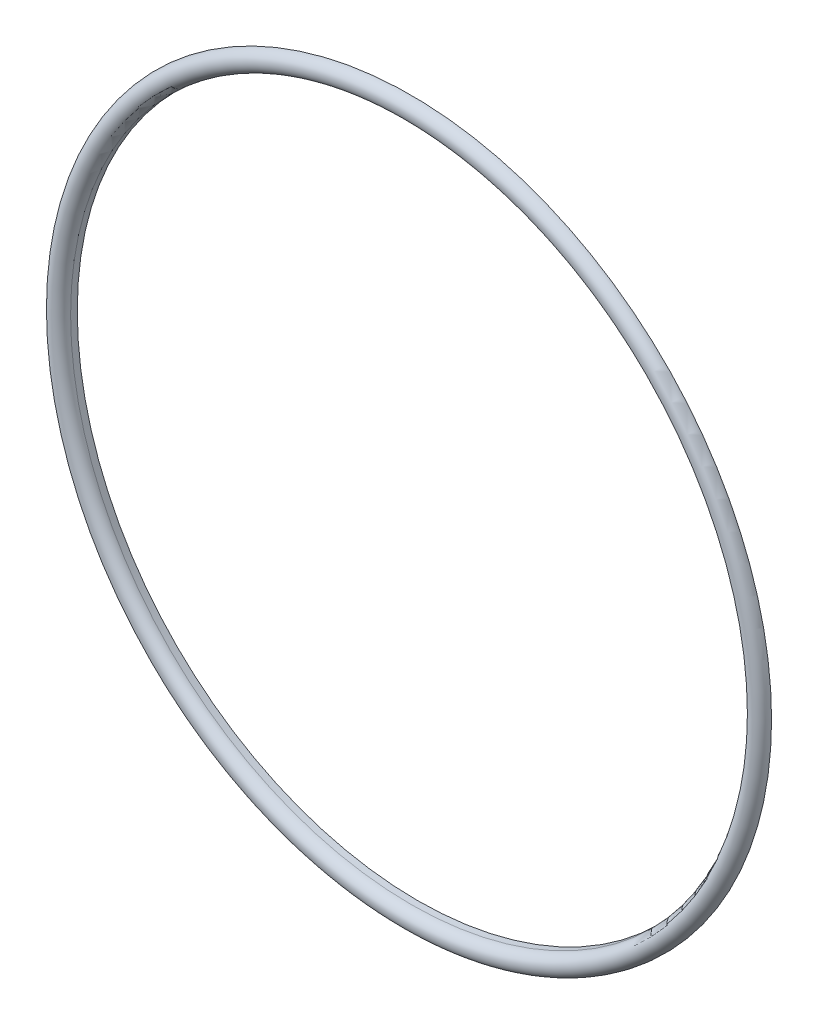
ISO-10303-21;
HEADER;
FILE_DESCRIPTION(('STEP AP214'),'2;1');
FILE_NAME('part.step','',(''),(''),'','','');
FILE_SCHEMA(('AUTOMOTIVE_DESIGN { 1 0 10303 214 1 1 1 1 }'));
ENDSEC;
DATA;
#1=APPLICATION_CONTEXT('core data for automotive mechanical design processes');
#2=APPLICATION_PROTOCOL_DEFINITION('international standard','automotive_design',2000,#1);
#3=PRODUCT_CONTEXT('',#1,'mechanical');
#4=PRODUCT('Part','Part','',(#3));
#5=PRODUCT_RELATED_PRODUCT_CATEGORY('part','',(#4));
#6=PRODUCT_DEFINITION_FORMATION('','',#4);
#7=PRODUCT_DEFINITION_CONTEXT('part definition',#1,'design');
#8=PRODUCT_DEFINITION('design','',#6,#7);
#9=PRODUCT_DEFINITION_SHAPE('','',#8);
#10=(LENGTH_UNIT() NAMED_UNIT(*) SI_UNIT(.MILLI.,.METRE.));
#11=(NAMED_UNIT(*) PLANE_ANGLE_UNIT() SI_UNIT($,.RADIAN.));
#12=(NAMED_UNIT(*) SI_UNIT($,.STERADIAN.) SOLID_ANGLE_UNIT());
#13=UNCERTAINTY_MEASURE_WITH_UNIT(LENGTH_MEASURE(1.E-05),#10,'distance_accuracy_value','');
#14=(GEOMETRIC_REPRESENTATION_CONTEXT(3) GLOBAL_UNCERTAINTY_ASSIGNED_CONTEXT((#13)) GLOBAL_UNIT_ASSIGNED_CONTEXT((#10,
#11,#12)) REPRESENTATION_CONTEXT('',''));
#15=CARTESIAN_POINT('',(0.,0.,0.));
#16=DIRECTION('',(0.,0.,1.));
#17=DIRECTION('',(1.,0.,0.));
#18=AXIS2_PLACEMENT_3D('',#15,#16,#17);
#19=CARTESIAN_POINT('',(0.,0.,0.));
#20=DIRECTION('',(0.,0.,-1.));
#21=DIRECTION('',(-1.,0.,0.));
#22=AXIS2_PLACEMENT_3D('',#19,#20,#21);
#23=CYLINDRICAL_SURFACE('',#22,52.5);
#24=CARTESIAN_POINT('',(0.,0.,0.));
#25=DIRECTION('',(0.,0.,-1.));
#26=DIRECTION('',(-1.,0.,0.));
#27=AXIS2_PLACEMENT_3D('',#24,#25,#26);
#28=CIRCLE('',#27,52.5);
#29=CARTESIAN_POINT('',(-52.5,0.,0.));
#30=VERTEX_POINT('',#29);
#31=EDGE_CURVE('E12',#30,#30,#28,.T.);
#32=ORIENTED_EDGE('',*,*,#31,.T.);
#33=EDGE_LOOP('',(#32));
#34=FACE_BOUND('',#33,.T.);
#35=CARTESIAN_POINT('',(0.,0.,-1.));
#36=DIRECTION('',(0.,0.,-1.));
#37=DIRECTION('',(-1.,0.,0.));
#38=AXIS2_PLACEMENT_3D('',#35,#36,#37);
#39=CIRCLE('',#38,52.5);
#40=CARTESIAN_POINT('',(-52.5,0.,-1.));
#41=VERTEX_POINT('',#40);
#42=EDGE_CURVE('E69',#41,#41,#39,.T.);
#43=ORIENTED_EDGE('',*,*,#42,.F.);
#44=EDGE_LOOP('',(#43));
#45=FACE_BOUND('',#44,.T.);
#46=ADVANCED_FACE('F46',(#34,#45),#23,.T.);
#47=CARTESIAN_POINT('',(0.,54.,0.));
#48=DIRECTION('',(0.,0.,-1.));
#49=DIRECTION('',(-1.,0.,0.));
#50=AXIS2_PLACEMENT_3D('',#47,#48,#49);
#51=PLANE('',#50);
#52=CARTESIAN_POINT('',(0.,0.,0.));
#53=DIRECTION('',(0.,0.,-1.));
#54=DIRECTION('',(-1.,0.,0.));
#55=AXIS2_PLACEMENT_3D('',#52,#53,#54);
#56=CIRCLE('',#55,54.);
#57=CARTESIAN_POINT('',(-54.,0.,0.));
#58=VERTEX_POINT('',#57);
#59=EDGE_CURVE('E53',#58,#58,#56,.T.);
#60=ORIENTED_EDGE('',*,*,#59,.T.);
#61=EDGE_LOOP('',(#60));
#62=FACE_BOUND('',#61,.T.);
#63=ORIENTED_EDGE('',*,*,#31,.F.);
#64=EDGE_LOOP('',(#63));
#65=FACE_BOUND('',#64,.T.);
#66=ADVANCED_FACE('F78',(#62,#65),#51,.T.);
#67=CARTESIAN_POINT('',(0.,0.,0.));
#68=DIRECTION('',(0.,0.,-1.));
#69=DIRECTION('',(-1.,0.,0.));
#70=AXIS2_PLACEMENT_3D('',#67,#68,#69);
#71=TOROIDAL_SURFACE('',#70,52.5,1.5);
#72=CARTESIAN_POINT('',(0.,0.,0.));
#73=DIRECTION('',(0.,0.,-1.));
#74=DIRECTION('',(-1.,0.,0.));
#75=AXIS2_PLACEMENT_3D('',#72,#73,#74);
#76=CIRCLE('',#75,51.);
#77=CARTESIAN_POINT('',(-51.,0.,0.));
#78=VERTEX_POINT('',#77);
#79=EDGE_CURVE('E59',#78,#78,#76,.T.);
#80=ORIENTED_EDGE('',*,*,#79,.T.);
#81=EDGE_LOOP('',(#80));
#82=FACE_BOUND('',#81,.T.);
#83=ORIENTED_EDGE('',*,*,#59,.F.);
#84=EDGE_LOOP('',(#83));
#85=FACE_BOUND('',#84,.T.);
#86=ADVANCED_FACE('F82',(#82,#85),#71,.T.);
#87=CARTESIAN_POINT('',(0.,0.,0.));
#88=DIRECTION('',(0.,0.,-1.));
#89=DIRECTION('',(-1.,0.,0.));
#90=AXIS2_PLACEMENT_3D('',#87,#88,#89);
#91=CYLINDRICAL_SURFACE('',#90,51.);
#92=CARTESIAN_POINT('',(0.,0.,-1.));
#93=DIRECTION('',(0.,0.,-1.));
#94=DIRECTION('',(-1.,0.,0.));
#95=AXIS2_PLACEMENT_3D('',#92,#93,#94);
#96=CIRCLE('',#95,51.);
#97=CARTESIAN_POINT('',(-51.,0.,-1.));
#98=VERTEX_POINT('',#97);
#99=EDGE_CURVE('E63',#98,#98,#96,.T.);
#100=ORIENTED_EDGE('',*,*,#99,.T.);
#101=EDGE_LOOP('',(#100));
#102=FACE_BOUND('',#101,.T.);
#103=ORIENTED_EDGE('',*,*,#79,.F.);
#104=EDGE_LOOP('',(#103));
#105=FACE_BOUND('',#104,.T.);
#106=ADVANCED_FACE('F86',(#102,#105),#91,.F.);
#107=CARTESIAN_POINT('',(0.,52.5,-1.));
#108=DIRECTION('',(0.,0.,-1.));
#109=DIRECTION('',(-1.,0.,0.));
#110=AXIS2_PLACEMENT_3D('',#107,#108,#109);
#111=PLANE('',#110);
#112=ORIENTED_EDGE('',*,*,#42,.T.);
#113=EDGE_LOOP('',(#112));
#114=FACE_BOUND('',#113,.T.);
#115=ORIENTED_EDGE('',*,*,#99,.F.);
#116=EDGE_LOOP('',(#115));
#117=FACE_BOUND('',#116,.T.);
#118=ADVANCED_FACE('F74',(#114,#117),#111,.T.);
#119=CLOSED_SHELL('',(#46,#66,#86,#106,#118));
#120=MANIFOLD_SOLID_BREP('B2',#119);
#121=ADVANCED_BREP_SHAPE_REPRESENTATION('',(#18,#120),#14);
#122=SHAPE_DEFINITION_REPRESENTATION(#9,#121);
ENDSEC;
END-ISO-10303-21;
